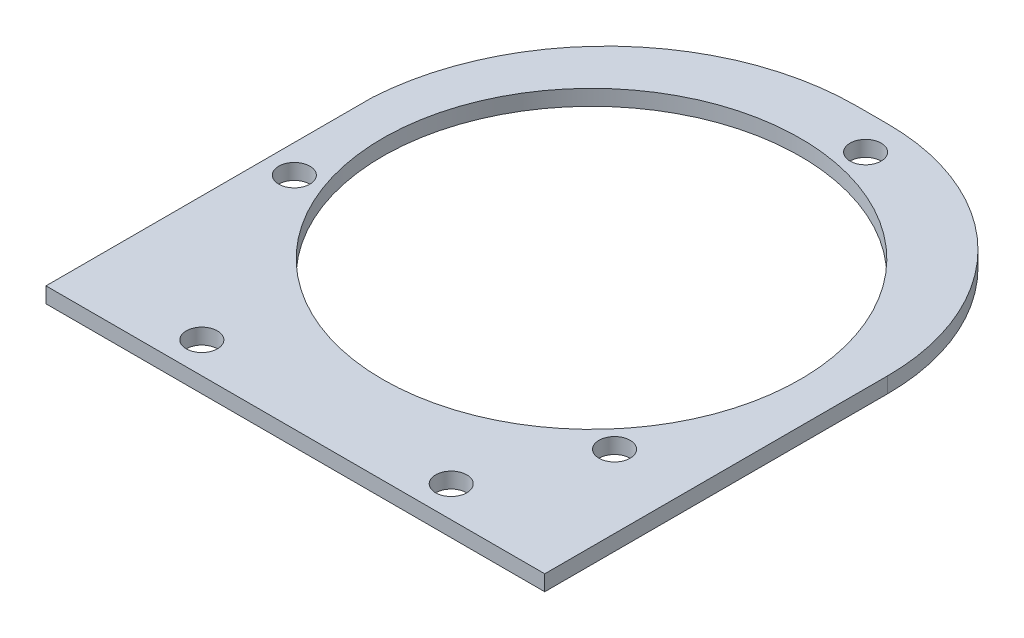
ISO-10303-21;
HEADER;
FILE_DESCRIPTION(('STEP AP214'),'2;1');
FILE_NAME('part.step','',(''),(''),'','','');
FILE_SCHEMA(('AUTOMOTIVE_DESIGN { 1 0 10303 214 1 1 1 1 }'));
ENDSEC;
DATA;
#1=APPLICATION_CONTEXT('core data for automotive mechanical design processes');
#2=APPLICATION_PROTOCOL_DEFINITION('international standard','automotive_design',2000,#1);
#3=PRODUCT_CONTEXT('',#1,'mechanical');
#4=PRODUCT('Part','Part','',(#3));
#5=PRODUCT_RELATED_PRODUCT_CATEGORY('part','',(#4));
#6=PRODUCT_DEFINITION_FORMATION('','',#4);
#7=PRODUCT_DEFINITION_CONTEXT('part definition',#1,'design');
#8=PRODUCT_DEFINITION('design','',#6,#7);
#9=PRODUCT_DEFINITION_SHAPE('','',#8);
#10=(LENGTH_UNIT() NAMED_UNIT(*) SI_UNIT(.MILLI.,.METRE.));
#11=(NAMED_UNIT(*) PLANE_ANGLE_UNIT() SI_UNIT($,.RADIAN.));
#12=(NAMED_UNIT(*) SI_UNIT($,.STERADIAN.) SOLID_ANGLE_UNIT());
#13=UNCERTAINTY_MEASURE_WITH_UNIT(LENGTH_MEASURE(1.E-05),#10,'distance_accuracy_value','');
#14=(GEOMETRIC_REPRESENTATION_CONTEXT(3) GLOBAL_UNCERTAINTY_ASSIGNED_CONTEXT((#13)) GLOBAL_UNIT_ASSIGNED_CONTEXT((#10,
#11,#12)) REPRESENTATION_CONTEXT('',''));
#15=CARTESIAN_POINT('',(0.,0.,0.));
#16=DIRECTION('',(0.,0.,1.));
#17=DIRECTION('',(1.,0.,0.));
#18=AXIS2_PLACEMENT_3D('',#15,#16,#17);
#19=CARTESIAN_POINT('',(12.7,6.35,-25.4000000000001));
#20=DIRECTION('',(0.,-1.,0.));
#21=DIRECTION('',(0.,0.,-1.));
#22=AXIS2_PLACEMENT_3D('',#19,#20,#21);
#23=PLANE('',#22);
#24=DIRECTION('',(0.,0.,1.));
#25=VECTOR('',#24,1.);
#26=CARTESIAN_POINT('',(-101.6,6.35,-18.6764705882367));
#27=LINE('',#26,#25);
#28=CARTESIAN_POINT('',(-101.6,6.35,-18.6764705882367));
#29=VERTEX_POINT('',#28);
#30=CARTESIAN_POINT('',(-101.6,6.35,114.3));
#31=VERTEX_POINT('',#30);
#32=EDGE_CURVE('E129',#29,#31,#27,.T.);
#33=ORIENTED_EDGE('',*,*,#32,.T.);
#34=DIRECTION('',(1.,0.,0.));
#35=VECTOR('',#34,1.);
#36=CARTESIAN_POINT('',(101.6,6.35,114.3));
#37=LINE('',#36,#35);
#38=CARTESIAN_POINT('',(101.6,6.35,114.3));
#39=VERTEX_POINT('',#38);
#40=EDGE_CURVE('E87',#31,#39,#37,.T.);
#41=ORIENTED_EDGE('',*,*,#40,.T.);
#42=DIRECTION('',(0.,0.,-1.));
#43=VECTOR('',#42,1.);
#44=CARTESIAN_POINT('',(101.6,6.35,-25.3999999999995));
#45=LINE('',#44,#43);
#46=CARTESIAN_POINT('',(101.6,6.35,-25.3999999999995));
#47=VERTEX_POINT('',#46);
#48=EDGE_CURVE('E100',#39,#47,#45,.T.);
#49=ORIENTED_EDGE('',*,*,#48,.T.);
#50=CARTESIAN_POINT('',(12.7,6.35,-25.4000000000001));
#51=DIRECTION('',(0.,1.,0.));
#52=DIRECTION('',(0.,0.,-1.));
#53=AXIS2_PLACEMENT_3D('',#50,#51,#52);
#54=CIRCLE('',#53,88.9);
#55=CARTESIAN_POINT('',(12.6999999999995,6.35,-114.3));
#56=VERTEX_POINT('',#55);
#57=EDGE_CURVE('E94',#47,#56,#54,.T.);
#58=ORIENTED_EDGE('',*,*,#57,.T.);
#59=DIRECTION('',(-1.,0.,0.));
#60=VECTOR('',#59,1.);
#61=CARTESIAN_POINT('',(12.6999999999995,6.35,-114.3));
#62=LINE('',#61,#60);
#63=CARTESIAN_POINT('',(0.,6.35,-114.3));
#64=VERTEX_POINT('',#63);
#65=EDGE_CURVE('E98',#56,#64,#62,.T.);
#66=ORIENTED_EDGE('',*,*,#65,.T.);
#67=CARTESIAN_POINT('',(0.,6.35,-12.5132352941176));
#68=DIRECTION('',(0.,1.,0.));
#69=DIRECTION('',(0.,0.,1.));
#70=AXIS2_PLACEMENT_3D('',#67,#68,#69);
#71=CIRCLE('',#70,101.786764705882);
#72=EDGE_CURVE('E50',#64,#29,#71,.T.);
#73=ORIENTED_EDGE('',*,*,#72,.T.);
#74=EDGE_LOOP('',(#33,#41,#49,#58,#66,#73));
#75=FACE_BOUND('',#74,.T.);
#76=CARTESIAN_POINT('',(0.,6.35,-6.35000000000014));
#77=DIRECTION('',(0.,1.,0.));
#78=DIRECTION('',(0.,0.,1.));
#79=AXIS2_PLACEMENT_3D('',#76,#77,#78);
#80=CIRCLE('',#79,85.09);
#81=CARTESIAN_POINT('',(0.,6.35,78.7399999999999));
#82=VERTEX_POINT('',#81);
#83=EDGE_CURVE('E122',#82,#82,#80,.T.);
#84=ORIENTED_EDGE('',*,*,#83,.F.);
#85=EDGE_LOOP('',(#84));
#86=FACE_BOUND('',#85,.T.);
#87=CARTESIAN_POINT('',(-90.0606443258351,6.35,24.6603667120435));
#88=DIRECTION('',(0.,1.,0.));
#89=DIRECTION('',(0.,0.,1.));
#90=AXIS2_PLACEMENT_3D('',#87,#88,#89);
#91=CIRCLE('',#90,6.35);
#92=CARTESIAN_POINT('',(-90.0606443258351,6.35,31.0103667120435));
#93=VERTEX_POINT('',#92);
#94=EDGE_CURVE('E213',#93,#93,#91,.T.);
#95=ORIENTED_EDGE('',*,*,#94,.F.);
#96=EDGE_LOOP('',(#95));
#97=FACE_BOUND('',#96,.T.);
#98=CARTESIAN_POINT('',(-50.8,6.35,101.6));
#99=DIRECTION('',(0.,1.,0.));
#100=DIRECTION('',(0.,0.,1.));
#101=AXIS2_PLACEMENT_3D('',#98,#99,#100);
#102=CIRCLE('',#101,6.35);
#103=CARTESIAN_POINT('',(-50.8,6.35,107.95));
#104=VERTEX_POINT('',#103);
#105=EDGE_CURVE('E207',#104,#104,#102,.T.);
#106=ORIENTED_EDGE('',*,*,#105,.F.);
#107=EDGE_LOOP('',(#106));
#108=FACE_BOUND('',#107,.T.);
#109=CARTESIAN_POINT('',(50.8,6.35,101.6));
#110=DIRECTION('',(0.,1.,0.));
#111=DIRECTION('',(0.,0.,-1.));
#112=AXIS2_PLACEMENT_3D('',#109,#110,#111);
#113=CIRCLE('',#112,6.35);
#114=CARTESIAN_POINT('',(50.8,6.35,95.2499999999999));
#115=VERTEX_POINT('',#114);
#116=EDGE_CURVE('E201',#115,#115,#113,.T.);
#117=ORIENTED_EDGE('',*,*,#116,.F.);
#118=EDGE_LOOP('',(#117));
#119=FACE_BOUND('',#118,.T.);
#120=CARTESIAN_POINT('',(18.174556809617,6.35,-99.84998922339));
#121=DIRECTION('',(0.,1.,0.));
#122=DIRECTION('',(0.,0.,1.));
#123=AXIS2_PLACEMENT_3D('',#120,#121,#122);
#124=CIRCLE('',#123,6.35000000000001);
#125=CARTESIAN_POINT('',(18.174556809617,6.35,-93.49998922339));
#126=VERTEX_POINT('',#125);
#127=EDGE_CURVE('E195',#126,#126,#124,.T.);
#128=ORIENTED_EDGE('',*,*,#127,.F.);
#129=EDGE_LOOP('',(#128));
#130=FACE_BOUND('',#129,.T.);
#131=CARTESIAN_POINT('',(71.8860875162182,6.35,56.1396225113469));
#132=DIRECTION('',(0.,1.,0.));
#133=DIRECTION('',(0.,0.,1.));
#134=AXIS2_PLACEMENT_3D('',#131,#132,#133);
#135=CIRCLE('',#134,6.35000000000001);
#136=CARTESIAN_POINT('',(71.8860875162182,6.35,62.4896225113469));
#137=VERTEX_POINT('',#136);
#138=EDGE_CURVE('E186',#137,#137,#135,.T.);
#139=ORIENTED_EDGE('',*,*,#138,.F.);
#140=EDGE_LOOP('',(#139));
#141=FACE_BOUND('',#140,.T.);
#142=ADVANCED_FACE('F33',(#75,#86,#97,#108,#119,#130,#141),#23,.F.);
#143=CARTESIAN_POINT('',(12.7,0.,-25.4000000000001));
#144=DIRECTION('',(0.,-1.,0.));
#145=DIRECTION('',(0.,0.,-1.));
#146=AXIS2_PLACEMENT_3D('',#143,#144,#145);
#147=PLANE('',#146);
#148=CARTESIAN_POINT('',(18.174556809617,0.,-99.84998922339));
#149=DIRECTION('',(0.,1.,0.));
#150=DIRECTION('',(0.,0.,1.));
#151=AXIS2_PLACEMENT_3D('',#148,#149,#150);
#152=CIRCLE('',#151,6.35000000000001);
#153=CARTESIAN_POINT('',(18.174556809617,0.,-93.49998922339));
#154=VERTEX_POINT('',#153);
#155=EDGE_CURVE('E192',#154,#154,#152,.T.);
#156=ORIENTED_EDGE('',*,*,#155,.T.);
#157=EDGE_LOOP('',(#156));
#158=FACE_BOUND('',#157,.T.);
#159=CARTESIAN_POINT('',(-50.8,0.,101.6));
#160=DIRECTION('',(0.,1.,0.));
#161=DIRECTION('',(0.,0.,1.));
#162=AXIS2_PLACEMENT_3D('',#159,#160,#161);
#163=CIRCLE('',#162,6.35);
#164=CARTESIAN_POINT('',(-50.8,0.,107.95));
#165=VERTEX_POINT('',#164);
#166=EDGE_CURVE('E204',#165,#165,#163,.T.);
#167=ORIENTED_EDGE('',*,*,#166,.T.);
#168=EDGE_LOOP('',(#167));
#169=FACE_BOUND('',#168,.T.);
#170=CARTESIAN_POINT('',(0.,0.,-6.35000000000014));
#171=DIRECTION('',(0.,1.,0.));
#172=DIRECTION('',(0.,0.,1.));
#173=AXIS2_PLACEMENT_3D('',#170,#171,#172);
#174=CIRCLE('',#173,85.09);
#175=CARTESIAN_POINT('',(0.,0.,78.7399999999999));
#176=VERTEX_POINT('',#175);
#177=EDGE_CURVE('E216',#176,#176,#174,.T.);
#178=ORIENTED_EDGE('',*,*,#177,.T.);
#179=EDGE_LOOP('',(#178));
#180=FACE_BOUND('',#179,.T.);
#181=DIRECTION('',(0.,0.,1.));
#182=VECTOR('',#181,1.);
#183=CARTESIAN_POINT('',(-101.6,0.,-18.6764705882367));
#184=LINE('',#183,#182);
#185=CARTESIAN_POINT('',(-101.6,0.,-18.6764705882367));
#186=VERTEX_POINT('',#185);
#187=CARTESIAN_POINT('',(-101.6,0.,114.3));
#188=VERTEX_POINT('',#187);
#189=EDGE_CURVE('E118',#186,#188,#184,.T.);
#190=ORIENTED_EDGE('',*,*,#189,.F.);
#191=CARTESIAN_POINT('',(0.,0.,-12.5132352941176));
#192=DIRECTION('',(0.,1.,0.));
#193=DIRECTION('',(0.,0.,1.));
#194=AXIS2_PLACEMENT_3D('',#191,#192,#193);
#195=CIRCLE('',#194,101.786764705882);
#196=CARTESIAN_POINT('',(0.,0.,-114.3));
#197=VERTEX_POINT('',#196);
#198=EDGE_CURVE('E79',#197,#186,#195,.T.);
#199=ORIENTED_EDGE('',*,*,#198,.F.);
#200=DIRECTION('',(-1.,0.,0.));
#201=VECTOR('',#200,1.);
#202=CARTESIAN_POINT('',(12.6999999999995,0.,-114.3));
#203=LINE('',#202,#201);
#204=CARTESIAN_POINT('',(12.6999999999995,0.,-114.3));
#205=VERTEX_POINT('',#204);
#206=EDGE_CURVE('E73',#205,#197,#203,.T.);
#207=ORIENTED_EDGE('',*,*,#206,.F.);
#208=CARTESIAN_POINT('',(12.7,0.,-25.4000000000001));
#209=DIRECTION('',(0.,1.,0.));
#210=DIRECTION('',(0.,0.,-1.));
#211=AXIS2_PLACEMENT_3D('',#208,#209,#210);
#212=CIRCLE('',#211,88.9);
#213=CARTESIAN_POINT('',(101.6,0.,-25.3999999999995));
#214=VERTEX_POINT('',#213);
#215=EDGE_CURVE('E108',#214,#205,#212,.T.);
#216=ORIENTED_EDGE('',*,*,#215,.F.);
#217=DIRECTION('',(0.,0.,-1.));
#218=VECTOR('',#217,1.);
#219=CARTESIAN_POINT('',(101.6,0.,-25.3999999999995));
#220=LINE('',#219,#218);
#221=CARTESIAN_POINT('',(101.6,0.,114.3));
#222=VERTEX_POINT('',#221);
#223=EDGE_CURVE('E124',#222,#214,#220,.T.);
#224=ORIENTED_EDGE('',*,*,#223,.F.);
#225=DIRECTION('',(1.,0.,0.));
#226=VECTOR('',#225,1.);
#227=CARTESIAN_POINT('',(101.6,0.,114.3));
#228=LINE('',#227,#226);
#229=EDGE_CURVE('E121',#188,#222,#228,.T.);
#230=ORIENTED_EDGE('',*,*,#229,.F.);
#231=EDGE_LOOP('',(#190,#199,#207,#216,#224,#230));
#232=FACE_BOUND('',#231,.T.);
#233=CARTESIAN_POINT('',(-90.0606443258351,0.,24.6603667120435));
#234=DIRECTION('',(0.,1.,0.));
#235=DIRECTION('',(0.,0.,1.));
#236=AXIS2_PLACEMENT_3D('',#233,#234,#235);
#237=CIRCLE('',#236,6.35);
#238=CARTESIAN_POINT('',(-90.0606443258351,0.,31.0103667120435));
#239=VERTEX_POINT('',#238);
#240=EDGE_CURVE('E210',#239,#239,#237,.T.);
#241=ORIENTED_EDGE('',*,*,#240,.T.);
#242=EDGE_LOOP('',(#241));
#243=FACE_BOUND('',#242,.T.);
#244=CARTESIAN_POINT('',(50.8,0.,101.6));
#245=DIRECTION('',(0.,1.,0.));
#246=DIRECTION('',(0.,0.,-1.));
#247=AXIS2_PLACEMENT_3D('',#244,#245,#246);
#248=CIRCLE('',#247,6.35);
#249=CARTESIAN_POINT('',(50.8,0.,95.2499999999999));
#250=VERTEX_POINT('',#249);
#251=EDGE_CURVE('E198',#250,#250,#248,.T.);
#252=ORIENTED_EDGE('',*,*,#251,.T.);
#253=EDGE_LOOP('',(#252));
#254=FACE_BOUND('',#253,.T.);
#255=CARTESIAN_POINT('',(71.8860875162182,0.,56.1396225113469));
#256=DIRECTION('',(0.,1.,0.));
#257=DIRECTION('',(0.,0.,1.));
#258=AXIS2_PLACEMENT_3D('',#255,#256,#257);
#259=CIRCLE('',#258,6.35000000000001);
#260=CARTESIAN_POINT('',(71.8860875162182,0.,62.4896225113469));
#261=VERTEX_POINT('',#260);
#262=EDGE_CURVE('E189',#261,#261,#259,.T.);
#263=ORIENTED_EDGE('',*,*,#262,.T.);
#264=EDGE_LOOP('',(#263));
#265=FACE_BOUND('',#264,.T.);
#266=ADVANCED_FACE('F138',(#158,#169,#180,#232,#243,#254,#265),#147,.T.);
#267=CARTESIAN_POINT('',(-101.6,6.35,-18.6764705882367));
#268=DIRECTION('',(1.,0.,0.));
#269=DIRECTION('',(0.,0.,-1.));
#270=AXIS2_PLACEMENT_3D('',#267,#268,#269);
#271=PLANE('',#270);
#272=ORIENTED_EDGE('',*,*,#189,.T.);
#273=DIRECTION('',(0.,-1.,0.));
#274=VECTOR('',#273,1.);
#275=CARTESIAN_POINT('',(-101.6,6.35,114.3));
#276=LINE('',#275,#274);
#277=EDGE_CURVE('E11',#31,#188,#276,.T.);
#278=ORIENTED_EDGE('',*,*,#277,.F.);
#279=ORIENTED_EDGE('',*,*,#32,.F.);
#280=DIRECTION('',(0.,-1.,0.));
#281=VECTOR('',#280,1.);
#282=CARTESIAN_POINT('',(-101.6,6.35,-18.6764705882367));
#283=LINE('',#282,#281);
#284=EDGE_CURVE('E114',#29,#186,#283,.T.);
#285=ORIENTED_EDGE('',*,*,#284,.T.);
#286=EDGE_LOOP('',(#272,#278,#279,#285));
#287=FACE_BOUND('',#286,.T.);
#288=ADVANCED_FACE('F35',(#287),#271,.F.);
#289=CARTESIAN_POINT('',(101.6,6.35,114.3));
#290=DIRECTION('',(0.,0.,-1.));
#291=DIRECTION('',(-1.,0.,0.));
#292=AXIS2_PLACEMENT_3D('',#289,#290,#291);
#293=PLANE('',#292);
#294=ORIENTED_EDGE('',*,*,#229,.T.);
#295=DIRECTION('',(0.,-1.,0.));
#296=VECTOR('',#295,1.);
#297=CARTESIAN_POINT('',(101.6,6.35,114.3));
#298=LINE('',#297,#296);
#299=EDGE_CURVE('E42',#39,#222,#298,.T.);
#300=ORIENTED_EDGE('',*,*,#299,.F.);
#301=ORIENTED_EDGE('',*,*,#40,.F.);
#302=ORIENTED_EDGE('',*,*,#277,.T.);
#303=EDGE_LOOP('',(#294,#300,#301,#302));
#304=FACE_BOUND('',#303,.T.);
#305=ADVANCED_FACE('F294',(#304),#293,.F.);
#306=CARTESIAN_POINT('',(101.6,6.35,-25.3999999999995));
#307=DIRECTION('',(-1.,0.,0.));
#308=DIRECTION('',(0.,0.,1.));
#309=AXIS2_PLACEMENT_3D('',#306,#307,#308);
#310=PLANE('',#309);
#311=ORIENTED_EDGE('',*,*,#223,.T.);
#312=DIRECTION('',(0.,-1.,0.));
#313=VECTOR('',#312,1.);
#314=CARTESIAN_POINT('',(101.6,6.35,-25.3999999999995));
#315=LINE('',#314,#313);
#316=EDGE_CURVE('E109',#47,#214,#315,.T.);
#317=ORIENTED_EDGE('',*,*,#316,.F.);
#318=ORIENTED_EDGE('',*,*,#48,.F.);
#319=ORIENTED_EDGE('',*,*,#299,.T.);
#320=EDGE_LOOP('',(#311,#317,#318,#319));
#321=FACE_BOUND('',#320,.T.);
#322=ADVANCED_FACE('F135',(#321),#310,.F.);
#323=CARTESIAN_POINT('',(12.7,6.35,-25.4000000000001));
#324=DIRECTION('',(0.,-1.,0.));
#325=DIRECTION('',(0.,0.,-1.));
#326=AXIS2_PLACEMENT_3D('',#323,#324,#325);
#327=CYLINDRICAL_SURFACE('',#326,88.9);
#328=ORIENTED_EDGE('',*,*,#215,.T.);
#329=DIRECTION('',(0.,-1.,0.));
#330=VECTOR('',#329,1.);
#331=CARTESIAN_POINT('',(12.6999999999995,6.35,-114.3));
#332=LINE('',#331,#330);
#333=EDGE_CURVE('E105',#56,#205,#332,.T.);
#334=ORIENTED_EDGE('',*,*,#333,.F.);
#335=ORIENTED_EDGE('',*,*,#57,.F.);
#336=ORIENTED_EDGE('',*,*,#316,.T.);
#337=EDGE_LOOP('',(#328,#334,#335,#336));
#338=FACE_BOUND('',#337,.T.);
#339=ADVANCED_FACE('F106',(#338),#327,.T.);
#340=CARTESIAN_POINT('',(12.6999999999995,6.35,-114.3));
#341=DIRECTION('',(0.,0.,1.));
#342=DIRECTION('',(1.,0.,0.));
#343=AXIS2_PLACEMENT_3D('',#340,#341,#342);
#344=PLANE('',#343);
#345=ORIENTED_EDGE('',*,*,#206,.T.);
#346=DIRECTION('',(0.,-1.,0.));
#347=VECTOR('',#346,1.);
#348=CARTESIAN_POINT('',(0.,6.35,-114.3));
#349=LINE('',#348,#347);
#350=EDGE_CURVE('E110',#64,#197,#349,.T.);
#351=ORIENTED_EDGE('',*,*,#350,.F.);
#352=ORIENTED_EDGE('',*,*,#65,.F.);
#353=ORIENTED_EDGE('',*,*,#333,.T.);
#354=EDGE_LOOP('',(#345,#351,#352,#353));
#355=FACE_BOUND('',#354,.T.);
#356=ADVANCED_FACE('F112',(#355),#344,.F.);
#357=CARTESIAN_POINT('',(0.,6.35,-12.5132352941176));
#358=DIRECTION('',(0.,-1.,0.));
#359=DIRECTION('',(0.,0.,-1.));
#360=AXIS2_PLACEMENT_3D('',#357,#358,#359);
#361=CYLINDRICAL_SURFACE('',#360,101.786764705882);
#362=ORIENTED_EDGE('',*,*,#198,.T.);
#363=ORIENTED_EDGE('',*,*,#284,.F.);
#364=ORIENTED_EDGE('',*,*,#72,.F.);
#365=ORIENTED_EDGE('',*,*,#350,.T.);
#366=EDGE_LOOP('',(#362,#363,#364,#365));
#367=FACE_BOUND('',#366,.T.);
#368=ADVANCED_FACE('F143',(#367),#361,.T.);
#369=CARTESIAN_POINT('',(0.,6.35,-6.35000000000014));
#370=DIRECTION('',(0.,-1.,0.));
#371=DIRECTION('',(0.,0.,-1.));
#372=AXIS2_PLACEMENT_3D('',#369,#370,#371);
#373=CYLINDRICAL_SURFACE('',#372,85.09);
#374=ORIENTED_EDGE('',*,*,#83,.T.);
#375=EDGE_LOOP('',(#374));
#376=FACE_BOUND('',#375,.T.);
#377=ORIENTED_EDGE('',*,*,#177,.F.);
#378=EDGE_LOOP('',(#377));
#379=FACE_BOUND('',#378,.T.);
#380=ADVANCED_FACE('F145',(#376,#379),#373,.F.);
#381=CARTESIAN_POINT('',(-90.0606443258351,6.35,24.6603667120435));
#382=DIRECTION('',(0.,-1.,0.));
#383=DIRECTION('',(0.,0.,-1.));
#384=AXIS2_PLACEMENT_3D('',#381,#382,#383);
#385=CYLINDRICAL_SURFACE('',#384,6.35);
#386=ORIENTED_EDGE('',*,*,#94,.T.);
#387=EDGE_LOOP('',(#386));
#388=FACE_BOUND('',#387,.T.);
#389=ORIENTED_EDGE('',*,*,#240,.F.);
#390=EDGE_LOOP('',(#389));
#391=FACE_BOUND('',#390,.T.);
#392=ADVANCED_FACE('F151',(#388,#391),#385,.F.);
#393=CARTESIAN_POINT('',(-50.8,6.35,101.6));
#394=DIRECTION('',(0.,-1.,0.));
#395=DIRECTION('',(0.,0.,-1.));
#396=AXIS2_PLACEMENT_3D('',#393,#394,#395);
#397=CYLINDRICAL_SURFACE('',#396,6.35);
#398=ORIENTED_EDGE('',*,*,#105,.T.);
#399=EDGE_LOOP('',(#398));
#400=FACE_BOUND('',#399,.T.);
#401=ORIENTED_EDGE('',*,*,#166,.F.);
#402=EDGE_LOOP('',(#401));
#403=FACE_BOUND('',#402,.T.);
#404=ADVANCED_FACE('F165',(#400,#403),#397,.F.);
#405=CARTESIAN_POINT('',(50.8,6.35,101.6));
#406=DIRECTION('',(0.,-1.,0.));
#407=DIRECTION('',(0.,0.,-1.));
#408=AXIS2_PLACEMENT_3D('',#405,#406,#407);
#409=CYLINDRICAL_SURFACE('',#408,6.35);
#410=ORIENTED_EDGE('',*,*,#116,.T.);
#411=EDGE_LOOP('',(#410));
#412=FACE_BOUND('',#411,.T.);
#413=ORIENTED_EDGE('',*,*,#251,.F.);
#414=EDGE_LOOP('',(#413));
#415=FACE_BOUND('',#414,.T.);
#416=ADVANCED_FACE('F169',(#412,#415),#409,.F.);
#417=CARTESIAN_POINT('',(18.174556809617,6.35,-99.84998922339));
#418=DIRECTION('',(0.,-1.,0.));
#419=DIRECTION('',(0.,0.,-1.));
#420=AXIS2_PLACEMENT_3D('',#417,#418,#419);
#421=CYLINDRICAL_SURFACE('',#420,6.35000000000001);
#422=ORIENTED_EDGE('',*,*,#127,.T.);
#423=EDGE_LOOP('',(#422));
#424=FACE_BOUND('',#423,.T.);
#425=ORIENTED_EDGE('',*,*,#155,.F.);
#426=EDGE_LOOP('',(#425));
#427=FACE_BOUND('',#426,.T.);
#428=ADVANCED_FACE('F173',(#424,#427),#421,.F.);
#429=CARTESIAN_POINT('',(71.8860875162182,6.35,56.1396225113469));
#430=DIRECTION('',(0.,-1.,0.));
#431=DIRECTION('',(0.,0.,-1.));
#432=AXIS2_PLACEMENT_3D('',#429,#430,#431);
#433=CYLINDRICAL_SURFACE('',#432,6.35000000000001);
#434=ORIENTED_EDGE('',*,*,#138,.T.);
#435=EDGE_LOOP('',(#434));
#436=FACE_BOUND('',#435,.T.);
#437=ORIENTED_EDGE('',*,*,#262,.F.);
#438=EDGE_LOOP('',(#437));
#439=FACE_BOUND('',#438,.T.);
#440=ADVANCED_FACE('F177',(#436,#439),#433,.F.);
#441=CLOSED_SHELL('',(#142,#266,#288,#305,#322,#339,#356,#368,#380,#392,#404,#416,#428,#440));
#442=MANIFOLD_SOLID_BREP('B2',#441);
#443=ADVANCED_BREP_SHAPE_REPRESENTATION('',(#18,#442),#14);
#444=SHAPE_DEFINITION_REPRESENTATION(#9,#443);
ENDSEC;
END-ISO-10303-21;
